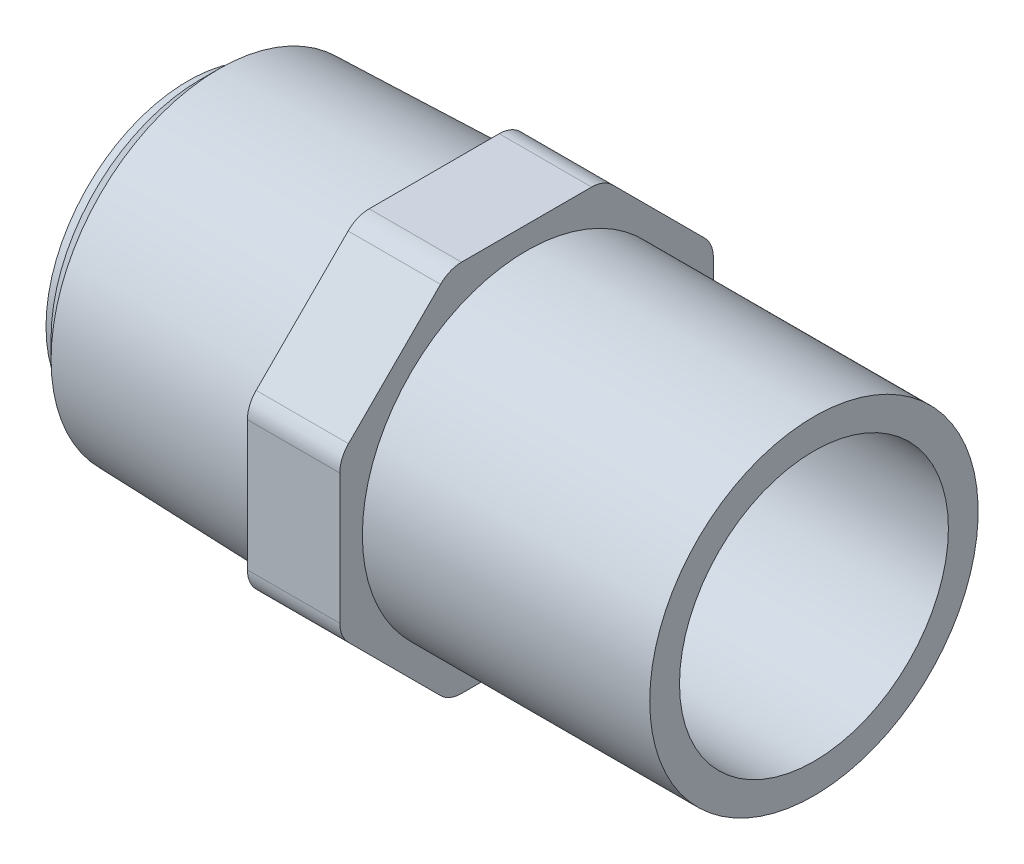
ISO-10303-21;
HEADER;
FILE_DESCRIPTION(('STEP AP214'),'2;1');
FILE_NAME('part.step','',(''),(''),'','','');
FILE_SCHEMA(('AUTOMOTIVE_DESIGN { 1 0 10303 214 1 1 1 1 }'));
ENDSEC;
DATA;
#1=APPLICATION_CONTEXT('core data for automotive mechanical design processes');
#2=APPLICATION_PROTOCOL_DEFINITION('international standard','automotive_design',2000,#1);
#3=PRODUCT_CONTEXT('',#1,'mechanical');
#4=PRODUCT('Part','Part','',(#3));
#5=PRODUCT_RELATED_PRODUCT_CATEGORY('part','',(#4));
#6=PRODUCT_DEFINITION_FORMATION('','',#4);
#7=PRODUCT_DEFINITION_CONTEXT('part definition',#1,'design');
#8=PRODUCT_DEFINITION('design','',#6,#7);
#9=PRODUCT_DEFINITION_SHAPE('','',#8);
#10=(LENGTH_UNIT() NAMED_UNIT(*) SI_UNIT(.MILLI.,.METRE.));
#11=(NAMED_UNIT(*) PLANE_ANGLE_UNIT() SI_UNIT($,.RADIAN.));
#12=(NAMED_UNIT(*) SI_UNIT($,.STERADIAN.) SOLID_ANGLE_UNIT());
#13=UNCERTAINTY_MEASURE_WITH_UNIT(LENGTH_MEASURE(1.E-05),#10,'distance_accuracy_value','');
#14=(GEOMETRIC_REPRESENTATION_CONTEXT(3) GLOBAL_UNCERTAINTY_ASSIGNED_CONTEXT((#13)) GLOBAL_UNIT_ASSIGNED_CONTEXT((#10,
#11,#12)) REPRESENTATION_CONTEXT('',''));
#15=CARTESIAN_POINT('',(0.,0.,0.));
#16=DIRECTION('',(0.,0.,1.));
#17=DIRECTION('',(1.,0.,0.));
#18=AXIS2_PLACEMENT_3D('',#15,#16,#17);
#19=CARTESIAN_POINT('',(-37.,-18.2,18.2));
#20=DIRECTION('',(-1.,0.,0.));
#21=DIRECTION('',(0.,1.,0.));
#22=AXIS2_PLACEMENT_3D('',#19,#20,#21);
#23=PLANE('',#22);
#24=CARTESIAN_POINT('',(-37.,0.,0.));
#25=DIRECTION('',(1.,0.,0.));
#26=DIRECTION('',(0.,0.,-1.));
#27=AXIS2_PLACEMENT_3D('',#24,#25,#26);
#28=CIRCLE('',#27,17.0101456723661);
#29=CARTESIAN_POINT('',(-37.,0.,-17.0101456723661));
#30=VERTEX_POINT('',#29);
#31=EDGE_CURVE('E18',#30,#30,#28,.F.);
#32=ORIENTED_EDGE('',*,*,#31,.F.);
#33=EDGE_LOOP('',(#32));
#34=FACE_BOUND('',#33,.T.);
#35=CARTESIAN_POINT('',(-37.,-15.3,6.33746750430836));
#36=DIRECTION('',(1.,0.,0.));
#37=DIRECTION('',(0.,1.,0.));
#38=AXIS2_PLACEMENT_3D('',#35,#36,#37);
#39=CIRCLE('',#38,2.89999999999998);
#40=CARTESIAN_POINT('',(-37.,-17.350609665441,8.38807716974933));
#41=VERTEX_POINT('',#40);
#42=CARTESIAN_POINT('',(-37.,-18.2,6.33746750430835));
#43=VERTEX_POINT('',#42);
#44=EDGE_CURVE('E235',#41,#43,#39,.T.);
#45=ORIENTED_EDGE('',*,*,#44,.F.);
#46=DIRECTION('',(0.,-0.707106781186547,-0.707106781186548));
#47=VECTOR('',#46,1.);
#48=CARTESIAN_POINT('',(-37.,-12.8693434175952,12.8693434175952));
#49=LINE('',#48,#47);
#50=CARTESIAN_POINT('',(-37.,-8.38807716974935,17.350609665441));
#51=VERTEX_POINT('',#50);
#52=EDGE_CURVE('E132',#51,#41,#49,.T.);
#53=ORIENTED_EDGE('',*,*,#52,.F.);
#54=CARTESIAN_POINT('',(-37.,-6.33746750430838,15.3));
#55=DIRECTION('',(1.,0.,0.));
#56=DIRECTION('',(0.,1.,0.));
#57=AXIS2_PLACEMENT_3D('',#54,#55,#56);
#58=CIRCLE('',#57,2.89999999999998);
#59=CARTESIAN_POINT('',(-37.,-6.33746750430837,18.2));
#60=VERTEX_POINT('',#59);
#61=EDGE_CURVE('E126',#60,#51,#58,.T.);
#62=ORIENTED_EDGE('',*,*,#61,.F.);
#63=DIRECTION('',(0.,-1.,0.));
#64=VECTOR('',#63,1.);
#65=CARTESIAN_POINT('',(-37.,0.,18.2));
#66=LINE('',#65,#64);
#67=CARTESIAN_POINT('',(-37.,6.33746750430835,18.2));
#68=VERTEX_POINT('',#67);
#69=EDGE_CURVE('E131',#68,#60,#66,.T.);
#70=ORIENTED_EDGE('',*,*,#69,.F.);
#71=CARTESIAN_POINT('',(-37.,6.33746750430835,15.3));
#72=DIRECTION('',(1.,0.,0.));
#73=DIRECTION('',(0.,0.,-1.));
#74=AXIS2_PLACEMENT_3D('',#71,#72,#73);
#75=CIRCLE('',#74,2.89999999999999);
#76=CARTESIAN_POINT('',(-37.,8.38807716974933,17.350609665441));
#77=VERTEX_POINT('',#76);
#78=EDGE_CURVE('E147',#77,#68,#75,.T.);
#79=ORIENTED_EDGE('',*,*,#78,.F.);
#80=DIRECTION('',(0.,-0.707106781186548,0.707106781186547));
#81=VECTOR('',#80,1.);
#82=CARTESIAN_POINT('',(-37.,12.8693434175952,12.8693434175952));
#83=LINE('',#82,#81);
#84=CARTESIAN_POINT('',(-37.,17.350609665441,8.38807716974934));
#85=VERTEX_POINT('',#84);
#86=EDGE_CURVE('E151',#85,#77,#83,.T.);
#87=ORIENTED_EDGE('',*,*,#86,.F.);
#88=CARTESIAN_POINT('',(-37.,15.3,6.33746750430837));
#89=DIRECTION('',(1.,0.,0.));
#90=DIRECTION('',(0.,0.,-1.));
#91=AXIS2_PLACEMENT_3D('',#88,#89,#90);
#92=CIRCLE('',#91,2.89999999999999);
#93=CARTESIAN_POINT('',(-37.,18.2,6.33746750430836));
#94=VERTEX_POINT('',#93);
#95=EDGE_CURVE('E225',#94,#85,#92,.T.);
#96=ORIENTED_EDGE('',*,*,#95,.F.);
#97=DIRECTION('',(0.,0.,1.));
#98=VECTOR('',#97,1.);
#99=CARTESIAN_POINT('',(-37.,18.2,0.));
#100=LINE('',#99,#98);
#101=CARTESIAN_POINT('',(-37.,18.2,-6.33746750430834));
#102=VERTEX_POINT('',#101);
#103=EDGE_CURVE('E155',#102,#94,#100,.T.);
#104=ORIENTED_EDGE('',*,*,#103,.F.);
#105=CARTESIAN_POINT('',(-37.,15.3,-6.33746750430834));
#106=DIRECTION('',(1.,0.,0.));
#107=DIRECTION('',(0.,1.,0.));
#108=AXIS2_PLACEMENT_3D('',#105,#106,#107);
#109=CIRCLE('',#108,2.89999999999999);
#110=CARTESIAN_POINT('',(-37.,17.350609665441,-8.38807716974932));
#111=VERTEX_POINT('',#110);
#112=EDGE_CURVE('E227',#111,#102,#109,.T.);
#113=ORIENTED_EDGE('',*,*,#112,.F.);
#114=DIRECTION('',(0.,0.707106781186547,0.707106781186548));
#115=VECTOR('',#114,1.);
#116=CARTESIAN_POINT('',(-37.,12.8693434175952,-12.8693434175952));
#117=LINE('',#116,#115);
#118=CARTESIAN_POINT('',(-37.,8.38807716974935,-17.350609665441));
#119=VERTEX_POINT('',#118);
#120=EDGE_CURVE('E159',#119,#111,#117,.T.);
#121=ORIENTED_EDGE('',*,*,#120,.F.);
#122=CARTESIAN_POINT('',(-37.,6.33746750430836,-15.3));
#123=DIRECTION('',(1.,0.,0.));
#124=DIRECTION('',(0.,1.,0.));
#125=AXIS2_PLACEMENT_3D('',#122,#123,#124);
#126=CIRCLE('',#125,2.90000000000002);
#127=CARTESIAN_POINT('',(-37.,6.33746750430836,-18.2));
#128=VERTEX_POINT('',#127);
#129=EDGE_CURVE('E229',#128,#119,#126,.T.);
#130=ORIENTED_EDGE('',*,*,#129,.F.);
#131=DIRECTION('',(0.,1.,0.));
#132=VECTOR('',#131,1.);
#133=CARTESIAN_POINT('',(-37.,0.,-18.2));
#134=LINE('',#133,#132);
#135=CARTESIAN_POINT('',(-37.,-6.33746750430835,-18.2));
#136=VERTEX_POINT('',#135);
#137=EDGE_CURVE('E163',#136,#128,#134,.T.);
#138=ORIENTED_EDGE('',*,*,#137,.F.);
#139=CARTESIAN_POINT('',(-37.,-6.33746750430835,-15.3));
#140=DIRECTION('',(1.,0.,0.));
#141=DIRECTION('',(0.,0.,-1.));
#142=AXIS2_PLACEMENT_3D('',#139,#140,#141);
#143=CIRCLE('',#142,2.9);
#144=CARTESIAN_POINT('',(-37.,-8.38807716974934,-17.350609665441));
#145=VERTEX_POINT('',#144);
#146=EDGE_CURVE('E231',#145,#136,#143,.T.);
#147=ORIENTED_EDGE('',*,*,#146,.F.);
#148=DIRECTION('',(0.,0.707106781186548,-0.707106781186547));
#149=VECTOR('',#148,1.);
#150=CARTESIAN_POINT('',(-37.,-12.8693434175952,-12.8693434175952));
#151=LINE('',#150,#149);
#152=CARTESIAN_POINT('',(-37.,-17.350609665441,-8.38807716974937));
#153=VERTEX_POINT('',#152);
#154=EDGE_CURVE('E167',#153,#145,#151,.T.);
#155=ORIENTED_EDGE('',*,*,#154,.F.);
#156=CARTESIAN_POINT('',(-37.,-15.3,-6.33746750430836));
#157=DIRECTION('',(1.,0.,0.));
#158=DIRECTION('',(0.,0.,-1.));
#159=AXIS2_PLACEMENT_3D('',#156,#157,#158);
#160=CIRCLE('',#159,2.90000000000005);
#161=CARTESIAN_POINT('',(-37.,-18.2,-6.33746750430836));
#162=VERTEX_POINT('',#161);
#163=EDGE_CURVE('E233',#162,#153,#160,.T.);
#164=ORIENTED_EDGE('',*,*,#163,.F.);
#165=DIRECTION('',(0.,0.,-1.));
#166=VECTOR('',#165,1.);
#167=CARTESIAN_POINT('',(-37.,-18.2,0.));
#168=LINE('',#167,#166);
#169=EDGE_CURVE('E171',#43,#162,#168,.T.);
#170=ORIENTED_EDGE('',*,*,#169,.F.);
#171=EDGE_LOOP('',(#45,#53,#62,#70,#79,#87,#96,#104,#113,#121,#130,#138,#147,#155,#164,#170));
#172=FACE_BOUND('',#171,.T.);
#173=ADVANCED_FACE('F15',(#34,#172),#23,.T.);
#174=CARTESIAN_POINT('',(-57.9730979570329,0.,0.));
#175=DIRECTION('',(1.,0.,0.));
#176=DIRECTION('',(0.,0.,-1.));
#177=AXIS2_PLACEMENT_3D('',#174,#175,#176);
#178=CONICAL_SURFACE('',#177,16.3569020429671,0.0311366738555789);
#179=CARTESIAN_POINT('',(-57.9730979570329,0.,0.));
#180=DIRECTION('',(-1.,0.,0.));
#181=DIRECTION('',(0.,1.,0.));
#182=AXIS2_PLACEMENT_3D('',#179,#180,#181);
#183=CIRCLE('',#182,16.3569020429671);
#184=CARTESIAN_POINT('',(-57.9730979570329,16.3569020429671,0.));
#185=VERTEX_POINT('',#184);
#186=EDGE_CURVE('E143',#185,#185,#183,.T.);
#187=ORIENTED_EDGE('',*,*,#186,.F.);
#188=EDGE_LOOP('',(#187));
#189=FACE_BOUND('',#188,.T.);
#190=ORIENTED_EDGE('',*,*,#31,.T.);
#191=EDGE_LOOP('',(#190));
#192=FACE_BOUND('',#191,.T.);
#193=ADVANCED_FACE('F537',(#189,#192),#178,.T.);
#194=CARTESIAN_POINT('',(-28.,-6.33746750430837,15.3));
#195=DIRECTION('',(1.,0.,0.));
#196=DIRECTION('',(0.,1.,0.));
#197=AXIS2_PLACEMENT_3D('',#194,#195,#196);
#198=CYLINDRICAL_SURFACE('',#197,2.89999999999998);
#199=ORIENTED_EDGE('',*,*,#61,.T.);
#200=DIRECTION('',(1.,0.,0.));
#201=VECTOR('',#200,1.);
#202=CARTESIAN_POINT('',(-37.,-8.38807716974935,17.350609665441));
#203=LINE('',#202,#201);
#204=CARTESIAN_POINT('',(-28.,-8.38807716974935,17.350609665441));
#205=VERTEX_POINT('',#204);
#206=EDGE_CURVE('E135',#205,#51,#203,.F.);
#207=ORIENTED_EDGE('',*,*,#206,.F.);
#208=CARTESIAN_POINT('',(-28.,-6.33746750430837,15.3));
#209=DIRECTION('',(1.,0.,0.));
#210=DIRECTION('',(0.,1.,0.));
#211=AXIS2_PLACEMENT_3D('',#208,#209,#210);
#212=CIRCLE('',#211,2.89999999999998);
#213=CARTESIAN_POINT('',(-28.,-6.33746750430837,18.2));
#214=VERTEX_POINT('',#213);
#215=EDGE_CURVE('E140',#214,#205,#212,.T.);
#216=ORIENTED_EDGE('',*,*,#215,.F.);
#217=DIRECTION('',(1.,0.,0.));
#218=VECTOR('',#217,1.);
#219=CARTESIAN_POINT('',(-37.,-6.33746750430836,18.2));
#220=LINE('',#219,#218);
#221=EDGE_CURVE('E137',#60,#214,#220,.T.);
#222=ORIENTED_EDGE('',*,*,#221,.F.);
#223=EDGE_LOOP('',(#199,#207,#216,#222));
#224=FACE_BOUND('',#223,.T.);
#225=ADVANCED_FACE('F138',(#224),#198,.T.);
#226=CARTESIAN_POINT('',(-37.,-8.38807716974935,17.350609665441));
#227=DIRECTION('',(0.,-0.707106781186548,0.707106781186547));
#228=DIRECTION('',(0.,-0.707106781186547,-0.707106781186548));
#229=AXIS2_PLACEMENT_3D('',#226,#227,#228);
#230=PLANE('',#229);
#231=ORIENTED_EDGE('',*,*,#52,.T.);
#232=DIRECTION('',(-1.,0.,0.));
#233=VECTOR('',#232,1.);
#234=CARTESIAN_POINT('',(-32.5,-17.350609665441,8.38807716974934));
#235=LINE('',#234,#233);
#236=CARTESIAN_POINT('',(-28.,-17.350609665441,8.38807716974934));
#237=VERTEX_POINT('',#236);
#238=EDGE_CURVE('E175',#237,#41,#235,.T.);
#239=ORIENTED_EDGE('',*,*,#238,.F.);
#240=CARTESIAN_POINT('',(-28.,-8.38807716974935,17.350609665441));
#241=CARTESIAN_POINT('',(-28.,-8.7615160237365,16.9771708114538));
#242=CARTESIAN_POINT('',(-28.,-9.13495487772365,16.6037319574667));
#243=CARTESIAN_POINT('',(-28.,-9.88183258569796,15.8568542494924));
#244=CARTESIAN_POINT('',(-28.,-10.2552714396851,15.4834153955052));
#245=CARTESIAN_POINT('',(-28.,-11.0021491476594,14.7365376875309));
#246=CARTESIAN_POINT('',(-28.,-11.3755880016466,14.3630988335438));
#247=CARTESIAN_POINT('',(-28.,-12.1224657096209,13.6162211255695));
#248=CARTESIAN_POINT('',(-28.,-12.495904563608,13.2427822715823));
#249=CARTESIAN_POINT('',(-28.,-13.2427822715823,12.495904563608));
#250=CARTESIAN_POINT('',(-28.,-13.6162211255695,12.1224657096209));
#251=CARTESIAN_POINT('',(-28.,-14.3630988335438,11.3755880016466));
#252=CARTESIAN_POINT('',(-28.,-14.7365376875309,11.0021491476594));
#253=CARTESIAN_POINT('',(-28.,-15.4834153955052,10.2552714396851));
#254=CARTESIAN_POINT('',(-28.,-15.8568542494924,9.88183258569795));
#255=CARTESIAN_POINT('',(-28.,-16.6037319574667,9.13495487772364));
#256=CARTESIAN_POINT('',(-28.,-16.9771708114538,8.76151602373649));
#257=CARTESIAN_POINT('',(-28.,-17.350609665441,8.38807716974934));
#258=B_SPLINE_CURVE_WITH_KNOTS('',3,(#240,#241,#242,#243,#244,#245,#246,#247,#248,#249,#250,
#251,#252,#253,#254,#255,#256,#257),.UNSPECIFIED.,.F.,.F.,(4,2,2,2,2,2,2,2,4),(0.,
1.58436687607709,3.16873375215417,4.75310062823126,6.33746750430835,7.92183438038544,
9.50620125646252,11.0905681325396,12.6749350086167),.UNSPECIFIED.);
#259=EDGE_CURVE('E222',#205,#237,#258,.T.);
#260=ORIENTED_EDGE('',*,*,#259,.F.);
#261=ORIENTED_EDGE('',*,*,#206,.T.);
#262=EDGE_LOOP('',(#231,#239,#260,#261));
#263=FACE_BOUND('',#262,.T.);
#264=ADVANCED_FACE('F369',(#263),#230,.T.);
#265=CARTESIAN_POINT('',(-28.,-15.3,6.33746750430836));
#266=DIRECTION('',(1.,0.,0.));
#267=DIRECTION('',(0.,1.,0.));
#268=AXIS2_PLACEMENT_3D('',#265,#266,#267);
#269=CYLINDRICAL_SURFACE('',#268,2.89999999999998);
#270=ORIENTED_EDGE('',*,*,#44,.T.);
#271=DIRECTION('',(1.,0.,0.));
#272=VECTOR('',#271,1.);
#273=CARTESIAN_POINT('',(-37.,-18.2,6.33746750430835));
#274=LINE('',#273,#272);
#275=CARTESIAN_POINT('',(-28.,-18.2,6.33746750430836));
#276=VERTEX_POINT('',#275);
#277=EDGE_CURVE('E174',#276,#43,#274,.F.);
#278=ORIENTED_EDGE('',*,*,#277,.F.);
#279=CARTESIAN_POINT('',(-28.,-15.3,6.33746750430836));
#280=DIRECTION('',(1.,0.,0.));
#281=DIRECTION('',(0.,1.,0.));
#282=AXIS2_PLACEMENT_3D('',#279,#280,#281);
#283=CIRCLE('',#282,2.89999999999998);
#284=EDGE_CURVE('E219',#237,#276,#283,.T.);
#285=ORIENTED_EDGE('',*,*,#284,.F.);
#286=ORIENTED_EDGE('',*,*,#238,.T.);
#287=EDGE_LOOP('',(#270,#278,#285,#286));
#288=FACE_BOUND('',#287,.T.);
#289=ADVANCED_FACE('F370',(#288),#269,.T.);
#290=CARTESIAN_POINT('',(-37.,-18.2,6.33746750430835));
#291=DIRECTION('',(0.,-1.,0.));
#292=DIRECTION('',(0.,0.,-1.));
#293=AXIS2_PLACEMENT_3D('',#290,#291,#292);
#294=PLANE('',#293);
#295=ORIENTED_EDGE('',*,*,#169,.T.);
#296=DIRECTION('',(-1.,0.,0.));
#297=VECTOR('',#296,1.);
#298=CARTESIAN_POINT('',(-32.5,-18.2,-6.33746750430837));
#299=LINE('',#298,#297);
#300=CARTESIAN_POINT('',(-28.,-18.2,-6.33746750430836));
#301=VERTEX_POINT('',#300);
#302=EDGE_CURVE('E173',#301,#162,#299,.T.);
#303=ORIENTED_EDGE('',*,*,#302,.F.);
#304=DIRECTION('',(0.,0.,-1.));
#305=VECTOR('',#304,1.);
#306=CARTESIAN_POINT('',(-28.,-18.2,18.2));
#307=LINE('',#306,#305);
#308=EDGE_CURVE('E218',#276,#301,#307,.T.);
#309=ORIENTED_EDGE('',*,*,#308,.F.);
#310=ORIENTED_EDGE('',*,*,#277,.T.);
#311=EDGE_LOOP('',(#295,#303,#309,#310));
#312=FACE_BOUND('',#311,.T.);
#313=ADVANCED_FACE('F326',(#312),#294,.T.);
#314=CARTESIAN_POINT('',(-28.,-15.3,-6.33746750430835));
#315=DIRECTION('',(1.,0.,0.));
#316=DIRECTION('',(0.,0.,-1.));
#317=AXIS2_PLACEMENT_3D('',#314,#315,#316);
#318=CYLINDRICAL_SURFACE('',#317,2.90000000000005);
#319=ORIENTED_EDGE('',*,*,#163,.T.);
#320=DIRECTION('',(1.,0.,0.));
#321=VECTOR('',#320,1.);
#322=CARTESIAN_POINT('',(-37.,-17.350609665441,-8.38807716974936));
#323=LINE('',#322,#321);
#324=CARTESIAN_POINT('',(-28.,-17.350609665441,-8.38807716974936));
#325=VERTEX_POINT('',#324);
#326=EDGE_CURVE('E170',#325,#153,#323,.F.);
#327=ORIENTED_EDGE('',*,*,#326,.F.);
#328=CARTESIAN_POINT('',(-28.,-15.3,-6.33746750430835));
#329=DIRECTION('',(1.,0.,0.));
#330=DIRECTION('',(0.,0.,-1.));
#331=AXIS2_PLACEMENT_3D('',#328,#329,#330);
#332=CIRCLE('',#331,2.90000000000005);
#333=EDGE_CURVE('E215',#301,#325,#332,.T.);
#334=ORIENTED_EDGE('',*,*,#333,.F.);
#335=ORIENTED_EDGE('',*,*,#302,.T.);
#336=EDGE_LOOP('',(#319,#327,#334,#335));
#337=FACE_BOUND('',#336,.T.);
#338=ADVANCED_FACE('F329',(#337),#318,.T.);
#339=CARTESIAN_POINT('',(-37.,-17.350609665441,-8.38807716974936));
#340=DIRECTION('',(0.,-0.707106781186547,-0.707106781186548));
#341=DIRECTION('',(0.,0.707106781186548,-0.707106781186547));
#342=AXIS2_PLACEMENT_3D('',#339,#340,#341);
#343=PLANE('',#342);
#344=ORIENTED_EDGE('',*,*,#154,.T.);
#345=DIRECTION('',(-1.,0.,0.));
#346=VECTOR('',#345,1.);
#347=CARTESIAN_POINT('',(-32.5,-8.38807716974934,-17.350609665441));
#348=LINE('',#347,#346);
#349=CARTESIAN_POINT('',(-28.,-8.38807716974934,-17.350609665441));
#350=VERTEX_POINT('',#349);
#351=EDGE_CURVE('E169',#350,#145,#348,.T.);
#352=ORIENTED_EDGE('',*,*,#351,.F.);
#353=CARTESIAN_POINT('',(-28.,-17.350609665441,-8.38807716974936));
#354=CARTESIAN_POINT('',(-28.,-16.9771708114538,-8.76151602373652));
#355=CARTESIAN_POINT('',(-28.,-16.6037319574667,-9.13495487772367));
#356=CARTESIAN_POINT('',(-28.,-15.8568542494924,-9.88183258569797));
#357=CARTESIAN_POINT('',(-28.,-15.4834153955052,-10.2552714396851));
#358=CARTESIAN_POINT('',(-28.,-14.7365376875309,-11.0021491476594));
#359=CARTESIAN_POINT('',(-28.,-14.3630988335438,-11.3755880016466));
#360=CARTESIAN_POINT('',(-28.,-13.6162211255695,-12.1224657096209));
#361=CARTESIAN_POINT('',(-28.,-13.2427822715823,-12.495904563608));
#362=CARTESIAN_POINT('',(-28.,-12.495904563608,-13.2427822715823));
#363=CARTESIAN_POINT('',(-28.,-12.1224657096209,-13.6162211255695));
#364=CARTESIAN_POINT('',(-28.,-11.3755880016466,-14.3630988335438));
#365=CARTESIAN_POINT('',(-28.,-11.0021491476594,-14.7365376875309));
#366=CARTESIAN_POINT('',(-28.,-10.2552714396851,-15.4834153955052));
#367=CARTESIAN_POINT('',(-28.,-9.88183258569794,-15.8568542494924));
#368=CARTESIAN_POINT('',(-28.,-9.13495487772364,-16.6037319574667));
#369=CARTESIAN_POINT('',(-28.,-8.76151602373649,-16.9771708114538));
#370=CARTESIAN_POINT('',(-28.,-8.38807716974934,-17.350609665441));
#371=B_SPLINE_CURVE_WITH_KNOTS('',3,(#353,#354,#355,#356,#357,#358,#359,#360,#361,#362,#363,
#364,#365,#366,#367,#368,#369,#370),.UNSPECIFIED.,.F.,.F.,(4,2,2,2,2,2,2,2,4),(0.,
1.58436687607709,3.16873375215417,4.75310062823127,6.33746750430835,7.92183438038543,
9.50620125646252,11.0905681325396,12.6749350086167),.UNSPECIFIED.);
#372=EDGE_CURVE('E214',#325,#350,#371,.T.);
#373=ORIENTED_EDGE('',*,*,#372,.F.);
#374=ORIENTED_EDGE('',*,*,#326,.T.);
#375=EDGE_LOOP('',(#344,#352,#373,#374));
#376=FACE_BOUND('',#375,.T.);
#377=ADVANCED_FACE('F333',(#376),#343,.T.);
#378=CARTESIAN_POINT('',(-28.,-6.33746750430835,-15.3));
#379=DIRECTION('',(1.,0.,0.));
#380=DIRECTION('',(0.,0.,-1.));
#381=AXIS2_PLACEMENT_3D('',#378,#379,#380);
#382=CYLINDRICAL_SURFACE('',#381,2.9);
#383=ORIENTED_EDGE('',*,*,#146,.T.);
#384=DIRECTION('',(1.,0.,0.));
#385=VECTOR('',#384,1.);
#386=CARTESIAN_POINT('',(-37.,-6.33746750430835,-18.2));
#387=LINE('',#386,#385);
#388=CARTESIAN_POINT('',(-28.,-6.33746750430835,-18.2));
#389=VERTEX_POINT('',#388);
#390=EDGE_CURVE('E166',#389,#136,#387,.F.);
#391=ORIENTED_EDGE('',*,*,#390,.F.);
#392=CARTESIAN_POINT('',(-28.,-6.33746750430835,-15.3));
#393=DIRECTION('',(1.,0.,0.));
#394=DIRECTION('',(0.,0.,-1.));
#395=AXIS2_PLACEMENT_3D('',#392,#393,#394);
#396=CIRCLE('',#395,2.9);
#397=EDGE_CURVE('E211',#350,#389,#396,.T.);
#398=ORIENTED_EDGE('',*,*,#397,.F.);
#399=ORIENTED_EDGE('',*,*,#351,.T.);
#400=EDGE_LOOP('',(#383,#391,#398,#399));
#401=FACE_BOUND('',#400,.T.);
#402=ADVANCED_FACE('F337',(#401),#382,.T.);
#403=CARTESIAN_POINT('',(-37.,-6.33746750430835,-18.2));
#404=DIRECTION('',(0.,0.,-1.));
#405=DIRECTION('',(0.,1.,0.));
#406=AXIS2_PLACEMENT_3D('',#403,#404,#405);
#407=PLANE('',#406);
#408=ORIENTED_EDGE('',*,*,#137,.T.);
#409=DIRECTION('',(-1.,0.,0.));
#410=VECTOR('',#409,1.);
#411=CARTESIAN_POINT('',(-32.5,6.33746750430836,-18.2));
#412=LINE('',#411,#410);
#413=CARTESIAN_POINT('',(-28.,6.33746750430836,-18.2));
#414=VERTEX_POINT('',#413);
#415=EDGE_CURVE('E165',#414,#128,#412,.T.);
#416=ORIENTED_EDGE('',*,*,#415,.F.);
#417=DIRECTION('',(0.,1.,0.));
#418=VECTOR('',#417,1.);
#419=CARTESIAN_POINT('',(-28.,0.,-18.2));
#420=LINE('',#419,#418);
#421=EDGE_CURVE('E210',#389,#414,#420,.T.);
#422=ORIENTED_EDGE('',*,*,#421,.F.);
#423=ORIENTED_EDGE('',*,*,#390,.T.);
#424=EDGE_LOOP('',(#408,#416,#422,#423));
#425=FACE_BOUND('',#424,.T.);
#426=ADVANCED_FACE('F341',(#425),#407,.T.);
#427=CARTESIAN_POINT('',(-28.,6.33746750430835,-15.3));
#428=DIRECTION('',(1.,0.,0.));
#429=DIRECTION('',(0.,1.,0.));
#430=AXIS2_PLACEMENT_3D('',#427,#428,#429);
#431=CYLINDRICAL_SURFACE('',#430,2.90000000000002);
#432=ORIENTED_EDGE('',*,*,#129,.T.);
#433=DIRECTION('',(1.,0.,0.));
#434=VECTOR('',#433,1.);
#435=CARTESIAN_POINT('',(-37.,8.38807716974934,-17.350609665441));
#436=LINE('',#435,#434);
#437=CARTESIAN_POINT('',(-28.,8.38807716974934,-17.350609665441));
#438=VERTEX_POINT('',#437);
#439=EDGE_CURVE('E162',#438,#119,#436,.F.);
#440=ORIENTED_EDGE('',*,*,#439,.F.);
#441=CARTESIAN_POINT('',(-28.,6.33746750430835,-15.3));
#442=DIRECTION('',(1.,0.,0.));
#443=DIRECTION('',(0.,1.,0.));
#444=AXIS2_PLACEMENT_3D('',#441,#442,#443);
#445=CIRCLE('',#444,2.90000000000002);
#446=EDGE_CURVE('E207',#414,#438,#445,.T.);
#447=ORIENTED_EDGE('',*,*,#446,.F.);
#448=ORIENTED_EDGE('',*,*,#415,.T.);
#449=EDGE_LOOP('',(#432,#440,#447,#448));
#450=FACE_BOUND('',#449,.T.);
#451=ADVANCED_FACE('F345',(#450),#431,.T.);
#452=CARTESIAN_POINT('',(-37.,8.38807716974934,-17.350609665441));
#453=DIRECTION('',(0.,0.707106781186548,-0.707106781186547));
#454=DIRECTION('',(0.,0.707106781186547,0.707106781186548));
#455=AXIS2_PLACEMENT_3D('',#452,#453,#454);
#456=PLANE('',#455);
#457=ORIENTED_EDGE('',*,*,#120,.T.);
#458=DIRECTION('',(-1.,0.,0.));
#459=VECTOR('',#458,1.);
#460=CARTESIAN_POINT('',(-32.5,17.350609665441,-8.38807716974933));
#461=LINE('',#460,#459);
#462=CARTESIAN_POINT('',(-28.,17.350609665441,-8.38807716974933));
#463=VERTEX_POINT('',#462);
#464=EDGE_CURVE('E161',#463,#111,#461,.T.);
#465=ORIENTED_EDGE('',*,*,#464,.F.);
#466=CARTESIAN_POINT('',(-28.,8.38807716974934,-17.350609665441));
#467=CARTESIAN_POINT('',(-28.,8.76151602373649,-16.9771708114538));
#468=CARTESIAN_POINT('',(-28.,9.13495487772364,-16.6037319574667));
#469=CARTESIAN_POINT('',(-28.,9.88183258569795,-15.8568542494924));
#470=CARTESIAN_POINT('',(-28.,10.2552714396851,-15.4834153955052));
#471=CARTESIAN_POINT('',(-28.,11.0021491476594,-14.7365376875309));
#472=CARTESIAN_POINT('',(-28.,11.3755880016466,-14.3630988335438));
#473=CARTESIAN_POINT('',(-28.,12.1224657096209,-13.6162211255695));
#474=CARTESIAN_POINT('',(-28.,12.495904563608,-13.2427822715823));
#475=CARTESIAN_POINT('',(-28.,13.2427822715823,-12.495904563608));
#476=CARTESIAN_POINT('',(-28.,13.6162211255695,-12.1224657096209));
#477=CARTESIAN_POINT('',(-28.,14.3630988335438,-11.3755880016465));
#478=CARTESIAN_POINT('',(-28.,14.7365376875309,-11.0021491476594));
#479=CARTESIAN_POINT('',(-28.,15.4834153955052,-10.2552714396851));
#480=CARTESIAN_POINT('',(-28.,15.8568542494924,-9.88183258569794));
#481=CARTESIAN_POINT('',(-28.,16.6037319574667,-9.13495487772363));
#482=CARTESIAN_POINT('',(-28.,16.9771708114538,-8.76151602373648));
#483=CARTESIAN_POINT('',(-28.,17.350609665441,-8.38807716974933));
#484=B_SPLINE_CURVE_WITH_KNOTS('',3,(#466,#467,#468,#469,#470,#471,#472,#473,#474,#475,#476,
#477,#478,#479,#480,#481,#482,#483),.UNSPECIFIED.,.F.,.F.,(4,2,2,2,2,2,2,2,4),(0.,
1.58436687607709,3.16873375215418,4.75310062823126,6.33746750430835,7.92183438038544,
9.50620125646252,11.0905681325396,12.6749350086167),.UNSPECIFIED.);
#485=EDGE_CURVE('E206',#438,#463,#484,.T.);
#486=ORIENTED_EDGE('',*,*,#485,.F.);
#487=ORIENTED_EDGE('',*,*,#439,.T.);
#488=EDGE_LOOP('',(#457,#465,#486,#487));
#489=FACE_BOUND('',#488,.T.);
#490=ADVANCED_FACE('F349',(#489),#456,.T.);
#491=CARTESIAN_POINT('',(-28.,15.3,-6.33746750430834));
#492=DIRECTION('',(1.,0.,0.));
#493=DIRECTION('',(0.,1.,0.));
#494=AXIS2_PLACEMENT_3D('',#491,#492,#493);
#495=CYLINDRICAL_SURFACE('',#494,2.89999999999999);
#496=ORIENTED_EDGE('',*,*,#112,.T.);
#497=DIRECTION('',(1.,0.,0.));
#498=VECTOR('',#497,1.);
#499=CARTESIAN_POINT('',(-37.,18.2,-6.33746750430835));
#500=LINE('',#499,#498);
#501=CARTESIAN_POINT('',(-28.,18.2,-6.33746750430835));
#502=VERTEX_POINT('',#501);
#503=EDGE_CURVE('E158',#502,#102,#500,.F.);
#504=ORIENTED_EDGE('',*,*,#503,.F.);
#505=CARTESIAN_POINT('',(-28.,15.3,-6.33746750430834));
#506=DIRECTION('',(1.,0.,0.));
#507=DIRECTION('',(0.,1.,0.));
#508=AXIS2_PLACEMENT_3D('',#505,#506,#507);
#509=CIRCLE('',#508,2.89999999999999);
#510=EDGE_CURVE('E203',#463,#502,#509,.T.);
#511=ORIENTED_EDGE('',*,*,#510,.F.);
#512=ORIENTED_EDGE('',*,*,#464,.T.);
#513=EDGE_LOOP('',(#496,#504,#511,#512));
#514=FACE_BOUND('',#513,.T.);
#515=ADVANCED_FACE('F353',(#514),#495,.T.);
#516=CARTESIAN_POINT('',(-37.,18.2,-6.33746750430835));
#517=DIRECTION('',(0.,1.,0.));
#518=DIRECTION('',(0.,0.,1.));
#519=AXIS2_PLACEMENT_3D('',#516,#517,#518);
#520=PLANE('',#519);
#521=ORIENTED_EDGE('',*,*,#103,.T.);
#522=DIRECTION('',(-1.,0.,0.));
#523=VECTOR('',#522,1.);
#524=CARTESIAN_POINT('',(-32.5,18.2,6.33746750430836));
#525=LINE('',#524,#523);
#526=CARTESIAN_POINT('',(-28.,18.2,6.33746750430836));
#527=VERTEX_POINT('',#526);
#528=EDGE_CURVE('E157',#527,#94,#525,.T.);
#529=ORIENTED_EDGE('',*,*,#528,.F.);
#530=DIRECTION('',(0.,0.,-1.));
#531=VECTOR('',#530,1.);
#532=CARTESIAN_POINT('',(-28.,18.2,18.2));
#533=LINE('',#532,#531);
#534=EDGE_CURVE('E202',#502,#527,#533,.F.);
#535=ORIENTED_EDGE('',*,*,#534,.F.);
#536=ORIENTED_EDGE('',*,*,#503,.T.);
#537=EDGE_LOOP('',(#521,#529,#535,#536));
#538=FACE_BOUND('',#537,.T.);
#539=ADVANCED_FACE('F357',(#538),#520,.T.);
#540=CARTESIAN_POINT('',(-28.,15.3,6.33746750430836));
#541=DIRECTION('',(1.,0.,0.));
#542=DIRECTION('',(0.,0.,-1.));
#543=AXIS2_PLACEMENT_3D('',#540,#541,#542);
#544=CYLINDRICAL_SURFACE('',#543,2.89999999999999);
#545=ORIENTED_EDGE('',*,*,#95,.T.);
#546=DIRECTION('',(1.,0.,0.));
#547=VECTOR('',#546,1.);
#548=CARTESIAN_POINT('',(-37.,17.350609665441,8.38807716974934));
#549=LINE('',#548,#547);
#550=CARTESIAN_POINT('',(-28.,17.350609665441,8.38807716974935));
#551=VERTEX_POINT('',#550);
#552=EDGE_CURVE('E154',#551,#85,#549,.F.);
#553=ORIENTED_EDGE('',*,*,#552,.F.);
#554=CARTESIAN_POINT('',(-28.,15.3,6.33746750430836));
#555=DIRECTION('',(1.,0.,0.));
#556=DIRECTION('',(0.,0.,-1.));
#557=AXIS2_PLACEMENT_3D('',#554,#555,#556);
#558=CIRCLE('',#557,2.89999999999999);
#559=EDGE_CURVE('E199',#527,#551,#558,.T.);
#560=ORIENTED_EDGE('',*,*,#559,.F.);
#561=ORIENTED_EDGE('',*,*,#528,.T.);
#562=EDGE_LOOP('',(#545,#553,#560,#561));
#563=FACE_BOUND('',#562,.T.);
#564=ADVANCED_FACE('F361',(#563),#544,.T.);
#565=CARTESIAN_POINT('',(-37.,17.350609665441,8.38807716974934));
#566=DIRECTION('',(0.,0.707106781186547,0.707106781186548));
#567=DIRECTION('',(0.,-0.707106781186548,0.707106781186547));
#568=AXIS2_PLACEMENT_3D('',#565,#566,#567);
#569=PLANE('',#568);
#570=ORIENTED_EDGE('',*,*,#86,.T.);
#571=DIRECTION('',(-1.,0.,0.));
#572=VECTOR('',#571,1.);
#573=CARTESIAN_POINT('',(-32.5,8.38807716974934,17.350609665441));
#574=LINE('',#573,#572);
#575=CARTESIAN_POINT('',(-28.,8.38807716974934,17.350609665441));
#576=VERTEX_POINT('',#575);
#577=EDGE_CURVE('E153',#576,#77,#574,.T.);
#578=ORIENTED_EDGE('',*,*,#577,.F.);
#579=CARTESIAN_POINT('',(-28.,17.350609665441,8.38807716974935));
#580=CARTESIAN_POINT('',(-28.,16.9771708114538,8.7615160237365));
#581=CARTESIAN_POINT('',(-28.,16.6037319574667,9.13495487772366));
#582=CARTESIAN_POINT('',(-28.,15.8568542494924,9.88183258569796));
#583=CARTESIAN_POINT('',(-28.,15.4834153955052,10.2552714396851));
#584=CARTESIAN_POINT('',(-28.,14.7365376875309,11.0021491476594));
#585=CARTESIAN_POINT('',(-28.,14.3630988335438,11.3755880016466));
#586=CARTESIAN_POINT('',(-28.,13.6162211255695,12.1224657096209));
#587=CARTESIAN_POINT('',(-28.,13.2427822715823,12.495904563608));
#588=CARTESIAN_POINT('',(-28.,12.495904563608,13.2427822715823));
#589=CARTESIAN_POINT('',(-28.,12.1224657096209,13.6162211255695));
#590=CARTESIAN_POINT('',(-28.,11.3755880016466,14.3630988335438));
#591=CARTESIAN_POINT('',(-28.,11.0021491476594,14.7365376875309));
#592=CARTESIAN_POINT('',(-28.,10.2552714396851,15.4834153955052));
#593=CARTESIAN_POINT('',(-28.,9.88183258569794,15.8568542494924));
#594=CARTESIAN_POINT('',(-28.,9.13495487772364,16.6037319574667));
#595=CARTESIAN_POINT('',(-28.,8.76151602373649,16.9771708114538));
#596=CARTESIAN_POINT('',(-28.,8.38807716974934,17.350609665441));
#597=B_SPLINE_CURVE_WITH_KNOTS('',3,(#579,#580,#581,#582,#583,#584,#585,#586,#587,#588,#589,
#590,#591,#592,#593,#594,#595,#596),.UNSPECIFIED.,.F.,.F.,(4,2,2,2,2,2,2,2,4),(0.,
1.58436687607709,3.16873375215417,4.75310062823126,6.33746750430835,7.92183438038543,
9.50620125646252,11.0905681325396,12.6749350086167),.UNSPECIFIED.);
#598=EDGE_CURVE('E198',#551,#576,#597,.T.);
#599=ORIENTED_EDGE('',*,*,#598,.F.);
#600=ORIENTED_EDGE('',*,*,#552,.T.);
#601=EDGE_LOOP('',(#570,#578,#599,#600));
#602=FACE_BOUND('',#601,.T.);
#603=ADVANCED_FACE('F365',(#602),#569,.T.);
#604=CARTESIAN_POINT('',(-28.,6.33746750430835,15.3));
#605=DIRECTION('',(1.,0.,0.));
#606=DIRECTION('',(0.,0.,-1.));
#607=AXIS2_PLACEMENT_3D('',#604,#605,#606);
#608=CYLINDRICAL_SURFACE('',#607,2.89999999999999);
#609=ORIENTED_EDGE('',*,*,#78,.T.);
#610=DIRECTION('',(1.,0.,0.));
#611=VECTOR('',#610,1.);
#612=CARTESIAN_POINT('',(-37.,6.33746750430836,18.2));
#613=LINE('',#612,#611);
#614=CARTESIAN_POINT('',(-28.,6.33746750430836,18.2));
#615=VERTEX_POINT('',#614);
#616=EDGE_CURVE('E33',#615,#68,#613,.F.);
#617=ORIENTED_EDGE('',*,*,#616,.F.);
#618=CARTESIAN_POINT('',(-28.,6.33746750430835,15.3));
#619=DIRECTION('',(1.,0.,0.));
#620=DIRECTION('',(0.,0.,-1.));
#621=AXIS2_PLACEMENT_3D('',#618,#619,#620);
#622=CIRCLE('',#621,2.89999999999999);
#623=EDGE_CURVE('E195',#576,#615,#622,.T.);
#624=ORIENTED_EDGE('',*,*,#623,.F.);
#625=ORIENTED_EDGE('',*,*,#577,.T.);
#626=EDGE_LOOP('',(#609,#617,#624,#625));
#627=FACE_BOUND('',#626,.T.);
#628=ADVANCED_FACE('F366',(#627),#608,.T.);
#629=CARTESIAN_POINT('',(-37.,6.33746750430836,18.2));
#630=DIRECTION('',(0.,0.,1.));
#631=DIRECTION('',(0.,-1.,0.));
#632=AXIS2_PLACEMENT_3D('',#629,#630,#631);
#633=PLANE('',#632);
#634=ORIENTED_EDGE('',*,*,#69,.T.);
#635=ORIENTED_EDGE('',*,*,#221,.T.);
#636=DIRECTION('',(0.,-1.,0.));
#637=VECTOR('',#636,1.);
#638=CARTESIAN_POINT('',(-28.,0.,18.2));
#639=LINE('',#638,#637);
#640=EDGE_CURVE('E194',#615,#214,#639,.T.);
#641=ORIENTED_EDGE('',*,*,#640,.F.);
#642=ORIENTED_EDGE('',*,*,#616,.T.);
#643=EDGE_LOOP('',(#634,#635,#641,#642));
#644=FACE_BOUND('',#643,.T.);
#645=ADVANCED_FACE('F145',(#644),#633,.T.);
#646=CARTESIAN_POINT('',(-59.8,0.,0.));
#647=DIRECTION('',(1.,0.,0.));
#648=DIRECTION('',(0.,0.,-1.));
#649=AXIS2_PLACEMENT_3D('',#646,#647,#648);
#650=CONICAL_SURFACE('',#649,14.53,0.785398163397444);
#651=CARTESIAN_POINT('',(-59.8,0.,0.));
#652=DIRECTION('',(1.,0.,0.));
#653=DIRECTION('',(0.,0.,-1.));
#654=AXIS2_PLACEMENT_3D('',#651,#652,#653);
#655=CIRCLE('',#654,14.53);
#656=CARTESIAN_POINT('',(-59.8,0.,-14.53));
#657=VERTEX_POINT('',#656);
#658=EDGE_CURVE('E191',#657,#657,#655,.F.);
#659=ORIENTED_EDGE('',*,*,#658,.F.);
#660=EDGE_LOOP('',(#659));
#661=FACE_BOUND('',#660,.T.);
#662=ORIENTED_EDGE('',*,*,#186,.T.);
#663=EDGE_LOOP('',(#662));
#664=FACE_BOUND('',#663,.T.);
#665=ADVANCED_FACE('F412',(#661,#664),#650,.T.);
#666=CARTESIAN_POINT('',(-28.,18.2,18.2));
#667=DIRECTION('',(1.,0.,0.));
#668=DIRECTION('',(0.,-1.,0.));
#669=AXIS2_PLACEMENT_3D('',#666,#667,#668);
#670=PLANE('',#669);
#671=CARTESIAN_POINT('',(-28.,0.,0.));
#672=DIRECTION('',(-1.,0.,0.));
#673=DIRECTION('',(0.,0.,1.));
#674=AXIS2_PLACEMENT_3D('',#671,#672,#673);
#675=CIRCLE('',#674,16.);
#676=CARTESIAN_POINT('',(-28.,0.,16.));
#677=VERTEX_POINT('',#676);
#678=EDGE_CURVE('E188',#677,#677,#675,.F.);
#679=ORIENTED_EDGE('',*,*,#678,.F.);
#680=EDGE_LOOP('',(#679));
#681=FACE_BOUND('',#680,.T.);
#682=ORIENTED_EDGE('',*,*,#623,.T.);
#683=ORIENTED_EDGE('',*,*,#640,.T.);
#684=ORIENTED_EDGE('',*,*,#215,.T.);
#685=ORIENTED_EDGE('',*,*,#259,.T.);
#686=ORIENTED_EDGE('',*,*,#284,.T.);
#687=ORIENTED_EDGE('',*,*,#308,.T.);
#688=ORIENTED_EDGE('',*,*,#333,.T.);
#689=ORIENTED_EDGE('',*,*,#372,.T.);
#690=ORIENTED_EDGE('',*,*,#397,.T.);
#691=ORIENTED_EDGE('',*,*,#421,.T.);
#692=ORIENTED_EDGE('',*,*,#446,.T.);
#693=ORIENTED_EDGE('',*,*,#485,.T.);
#694=ORIENTED_EDGE('',*,*,#510,.T.);
#695=ORIENTED_EDGE('',*,*,#534,.T.);
#696=ORIENTED_EDGE('',*,*,#559,.T.);
#697=ORIENTED_EDGE('',*,*,#598,.T.);
#698=EDGE_LOOP('',(#682,#683,#684,#685,#686,#687,#688,#689,#690,#691,#692,#693,#694,#695,#696,#697));
#699=FACE_BOUND('',#698,.T.);
#700=ADVANCED_FACE('F260',(#681,#699),#670,.T.);
#701=CARTESIAN_POINT('',(-59.8,-14.53,14.704362108269));
#702=DIRECTION('',(-1.,0.,0.));
#703=DIRECTION('',(0.,1.,0.));
#704=AXIS2_PLACEMENT_3D('',#701,#702,#703);
#705=PLANE('',#704);
#706=CARTESIAN_POINT('',(-59.8,0.,0.));
#707=DIRECTION('',(-1.,0.,0.));
#708=DIRECTION('',(0.,0.,1.));
#709=AXIS2_PLACEMENT_3D('',#706,#707,#708);
#710=CIRCLE('',#709,13.825);
#711=CARTESIAN_POINT('',(-59.8,0.,13.825));
#712=VERTEX_POINT('',#711);
#713=EDGE_CURVE('E185',#712,#712,#710,.T.);
#714=ORIENTED_EDGE('',*,*,#713,.F.);
#715=EDGE_LOOP('',(#714));
#716=FACE_BOUND('',#715,.T.);
#717=ORIENTED_EDGE('',*,*,#658,.T.);
#718=EDGE_LOOP('',(#717));
#719=FACE_BOUND('',#718,.T.);
#720=ADVANCED_FACE('F258',(#716,#719),#705,.T.);
#721=CARTESIAN_POINT('',(-28.,0.,0.));
#722=DIRECTION('',(-1.,0.,0.));
#723=DIRECTION('',(0.,0.,1.));
#724=AXIS2_PLACEMENT_3D('',#721,#722,#723);
#725=CYLINDRICAL_SURFACE('',#724,16.);
#726=ORIENTED_EDGE('',*,*,#678,.T.);
#727=EDGE_LOOP('',(#726));
#728=FACE_BOUND('',#727,.T.);
#729=CARTESIAN_POINT('',(0.,0.,0.));
#730=DIRECTION('',(-1.,0.,0.));
#731=DIRECTION('',(0.,0.,1.));
#732=AXIS2_PLACEMENT_3D('',#729,#730,#731);
#733=CIRCLE('',#732,16.);
#734=CARTESIAN_POINT('',(0.,0.,16.));
#735=VERTEX_POINT('',#734);
#736=EDGE_CURVE('E182',#735,#735,#733,.F.);
#737=ORIENTED_EDGE('',*,*,#736,.F.);
#738=EDGE_LOOP('',(#737));
#739=FACE_BOUND('',#738,.T.);
#740=ADVANCED_FACE('F398',(#728,#739),#725,.T.);
#741=CARTESIAN_POINT('',(-61.,0.,0.));
#742=DIRECTION('',(-1.,0.,0.));
#743=DIRECTION('',(0.,0.,1.));
#744=AXIS2_PLACEMENT_3D('',#741,#742,#743);
#745=CYLINDRICAL_SURFACE('',#744,13.825);
#746=CARTESIAN_POINT('',(-61.,0.,0.));
#747=DIRECTION('',(-1.,0.,0.));
#748=DIRECTION('',(0.,0.,1.));
#749=AXIS2_PLACEMENT_3D('',#746,#747,#748);
#750=CIRCLE('',#749,13.825);
#751=CARTESIAN_POINT('',(-61.,0.,13.825));
#752=VERTEX_POINT('',#751);
#753=EDGE_CURVE('E179',#752,#752,#750,.T.);
#754=ORIENTED_EDGE('',*,*,#753,.F.);
#755=EDGE_LOOP('',(#754));
#756=FACE_BOUND('',#755,.T.);
#757=ORIENTED_EDGE('',*,*,#713,.T.);
#758=EDGE_LOOP('',(#757));
#759=FACE_BOUND('',#758,.T.);
#760=ADVANCED_FACE('F395',(#756,#759),#745,.T.);
#761=CARTESIAN_POINT('',(0.,16.,16.1920021082986));
#762=DIRECTION('',(1.,0.,0.));
#763=DIRECTION('',(0.,-1.,0.));
#764=AXIS2_PLACEMENT_3D('',#761,#762,#763);
#765=PLANE('',#764);
#766=CARTESIAN_POINT('',(0.,0.,0.));
#767=DIRECTION('',(-1.,0.,0.));
#768=DIRECTION('',(0.,0.,1.));
#769=AXIS2_PLACEMENT_3D('',#766,#767,#768);
#770=CIRCLE('',#769,13.1);
#771=CARTESIAN_POINT('',(0.,0.,13.1));
#772=VERTEX_POINT('',#771);
#773=EDGE_CURVE('E24',#772,#772,#770,.F.);
#774=ORIENTED_EDGE('',*,*,#773,.F.);
#775=EDGE_LOOP('',(#774));
#776=FACE_BOUND('',#775,.T.);
#777=ORIENTED_EDGE('',*,*,#736,.T.);
#778=EDGE_LOOP('',(#777));
#779=FACE_BOUND('',#778,.T.);
#780=ADVANCED_FACE('F388',(#776,#779),#765,.T.);
#781=CARTESIAN_POINT('',(-61.,-13.825,13.990902108294));
#782=DIRECTION('',(-1.,0.,0.));
#783=DIRECTION('',(0.,1.,0.));
#784=AXIS2_PLACEMENT_3D('',#781,#782,#783);
#785=PLANE('',#784);
#786=CARTESIAN_POINT('',(-61.,0.,0.));
#787=DIRECTION('',(-1.,0.,0.));
#788=DIRECTION('',(0.,0.,1.));
#789=AXIS2_PLACEMENT_3D('',#786,#787,#788);
#790=CIRCLE('',#789,13.1);
#791=CARTESIAN_POINT('',(-61.,0.,13.1));
#792=VERTEX_POINT('',#791);
#793=EDGE_CURVE('E9',#792,#792,#790,.T.);
#794=ORIENTED_EDGE('',*,*,#793,.F.);
#795=EDGE_LOOP('',(#794));
#796=FACE_BOUND('',#795,.T.);
#797=ORIENTED_EDGE('',*,*,#753,.T.);
#798=EDGE_LOOP('',(#797));
#799=FACE_BOUND('',#798,.T.);
#800=ADVANCED_FACE('F382',(#796,#799),#785,.T.);
#801=CARTESIAN_POINT('',(0.,0.,0.));
#802=DIRECTION('',(-1.,0.,0.));
#803=DIRECTION('',(0.,0.,1.));
#804=AXIS2_PLACEMENT_3D('',#801,#802,#803);
#805=CYLINDRICAL_SURFACE('',#804,13.1);
#806=ORIENTED_EDGE('',*,*,#773,.T.);
#807=EDGE_LOOP('',(#806));
#808=FACE_BOUND('',#807,.T.);
#809=ORIENTED_EDGE('',*,*,#793,.T.);
#810=EDGE_LOOP('',(#809));
#811=FACE_BOUND('',#810,.T.);
#812=ADVANCED_FACE('F380',(#808,#811),#805,.F.);
#813=CLOSED_SHELL('',(#173,#193,#225,#264,#289,#313,#338,#377,#402,#426,#451,#490,#515,#539,
#564,#603,#628,#645,#665,#700,#720,#740,#760,#780,#800,#812));
#814=MANIFOLD_SOLID_BREP('B1',#813);
#815=ADVANCED_BREP_SHAPE_REPRESENTATION('',(#18,#814),#14);
#816=SHAPE_DEFINITION_REPRESENTATION(#9,#815);
ENDSEC;
END-ISO-10303-21;
